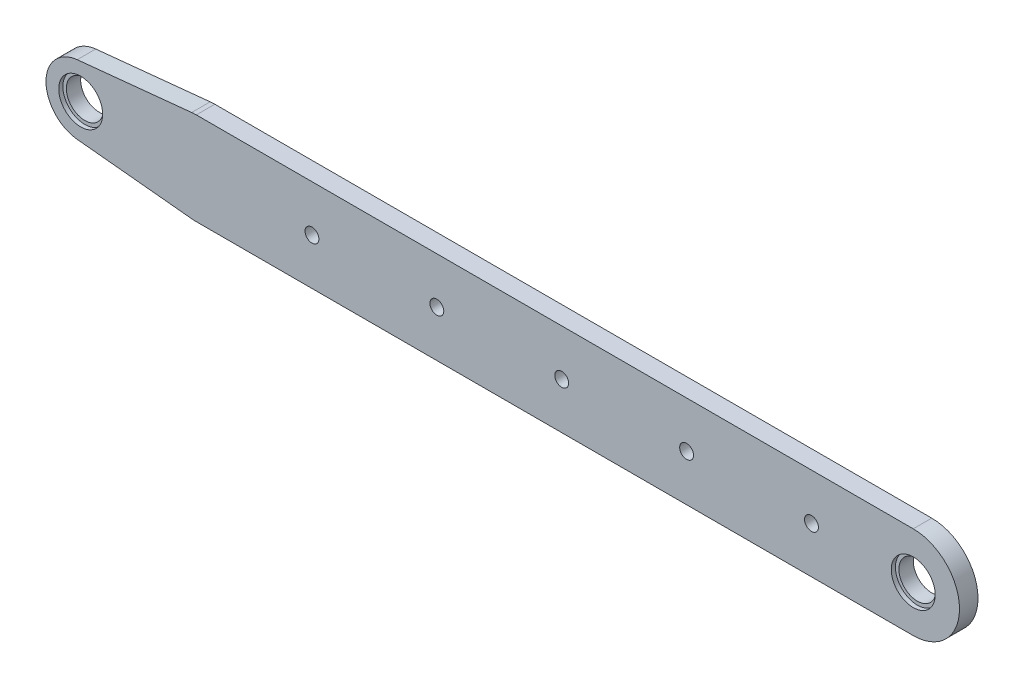
ISO-10303-21;
HEADER;
FILE_DESCRIPTION(('STEP AP214'),'2;1');
FILE_NAME('part.step','',(''),(''),'','','');
FILE_SCHEMA(('AUTOMOTIVE_DESIGN { 1 0 10303 214 1 1 1 1 }'));
ENDSEC;
DATA;
#1=APPLICATION_CONTEXT('core data for automotive mechanical design processes');
#2=APPLICATION_PROTOCOL_DEFINITION('international standard','automotive_design',2000,#1);
#3=PRODUCT_CONTEXT('',#1,'mechanical');
#4=PRODUCT('Part','Part','',(#3));
#5=PRODUCT_RELATED_PRODUCT_CATEGORY('part','',(#4));
#6=PRODUCT_DEFINITION_FORMATION('','',#4);
#7=PRODUCT_DEFINITION_CONTEXT('part definition',#1,'design');
#8=PRODUCT_DEFINITION('design','',#6,#7);
#9=PRODUCT_DEFINITION_SHAPE('','',#8);
#10=(LENGTH_UNIT() NAMED_UNIT(*) SI_UNIT(.MILLI.,.METRE.));
#11=(NAMED_UNIT(*) PLANE_ANGLE_UNIT() SI_UNIT($,.RADIAN.));
#12=(NAMED_UNIT(*) SI_UNIT($,.STERADIAN.) SOLID_ANGLE_UNIT());
#13=UNCERTAINTY_MEASURE_WITH_UNIT(LENGTH_MEASURE(1.E-05),#10,'distance_accuracy_value','');
#14=(GEOMETRIC_REPRESENTATION_CONTEXT(3) GLOBAL_UNCERTAINTY_ASSIGNED_CONTEXT((#13)) GLOBAL_UNIT_ASSIGNED_CONTEXT((#10,
#11,#12)) REPRESENTATION_CONTEXT('',''));
#15=CARTESIAN_POINT('',(0.,0.,0.));
#16=DIRECTION('',(0.,0.,1.));
#17=DIRECTION('',(1.,0.,0.));
#18=AXIS2_PLACEMENT_3D('',#15,#16,#17);
#19=CARTESIAN_POINT('',(0.,10.,4.));
#20=DIRECTION('',(0.,1.,0.));
#21=DIRECTION('',(0.,0.,1.));
#22=AXIS2_PLACEMENT_3D('',#19,#20,#21);
#23=PLANE('',#22);
#24=DIRECTION('',(1.,0.,0.));
#25=VECTOR('',#24,1.);
#26=CARTESIAN_POINT('',(0.,10.,0.));
#27=LINE('',#26,#25);
#28=CARTESIAN_POINT('',(-77.5,10.,0.));
#29=VERTEX_POINT('',#28);
#30=CARTESIAN_POINT('',(77.5,10.,0.));
#31=VERTEX_POINT('',#30);
#32=EDGE_CURVE('E138',#29,#31,#27,.T.);
#33=ORIENTED_EDGE('',*,*,#32,.F.);
#34=DIRECTION('',(0.,0.,-1.));
#35=VECTOR('',#34,1.);
#36=CARTESIAN_POINT('',(-77.5,10.,4.));
#37=LINE('',#36,#35);
#38=CARTESIAN_POINT('',(-77.5,10.,4.));
#39=VERTEX_POINT('',#38);
#40=EDGE_CURVE('E11',#39,#29,#37,.T.);
#41=ORIENTED_EDGE('',*,*,#40,.F.);
#42=DIRECTION('',(1.,0.,0.));
#43=VECTOR('',#42,1.);
#44=CARTESIAN_POINT('',(0.,10.,4.));
#45=LINE('',#44,#43);
#46=CARTESIAN_POINT('',(77.5,10.,4.));
#47=VERTEX_POINT('',#46);
#48=EDGE_CURVE('E155',#39,#47,#45,.T.);
#49=ORIENTED_EDGE('',*,*,#48,.T.);
#50=DIRECTION('',(0.,0.,-1.));
#51=VECTOR('',#50,1.);
#52=CARTESIAN_POINT('',(77.5,10.,4.));
#53=LINE('',#52,#51);
#54=EDGE_CURVE('E94',#47,#31,#53,.T.);
#55=ORIENTED_EDGE('',*,*,#54,.T.);
#56=EDGE_LOOP('',(#33,#41,#49,#55));
#57=FACE_BOUND('',#56,.T.);
#58=ADVANCED_FACE('F43',(#57),#23,.T.);
#59=CARTESIAN_POINT('',(-77.5,0.,4.));
#60=DIRECTION('',(0.,0.,-1.));
#61=DIRECTION('',(-1.,0.,0.));
#62=AXIS2_PLACEMENT_3D('',#59,#60,#61);
#63=CYLINDRICAL_SURFACE('',#62,10.);
#64=CARTESIAN_POINT('',(-77.5,0.,0.));
#65=DIRECTION('',(0.,0.,1.));
#66=DIRECTION('',(1.,0.,0.));
#67=AXIS2_PLACEMENT_3D('',#64,#65,#66);
#68=CIRCLE('',#67,10.);
#69=CARTESIAN_POINT('',(-78.5,9.94987437106622,0.));
#70=VERTEX_POINT('',#69);
#71=EDGE_CURVE('E141',#29,#70,#68,.T.);
#72=ORIENTED_EDGE('',*,*,#71,.T.);
#73=DIRECTION('',(0.,0.,-1.));
#74=VECTOR('',#73,1.);
#75=CARTESIAN_POINT('',(-78.5,9.94987437106622,4.));
#76=LINE('',#75,#74);
#77=CARTESIAN_POINT('',(-78.5,9.94987437106622,4.));
#78=VERTEX_POINT('',#77);
#79=EDGE_CURVE('E51',#78,#70,#76,.T.);
#80=ORIENTED_EDGE('',*,*,#79,.F.);
#81=CARTESIAN_POINT('',(-77.5,0.,4.));
#82=DIRECTION('',(0.,0.,1.));
#83=DIRECTION('',(1.,0.,0.));
#84=AXIS2_PLACEMENT_3D('',#81,#82,#83);
#85=CIRCLE('',#84,10.);
#86=EDGE_CURVE('E124',#39,#78,#85,.T.);
#87=ORIENTED_EDGE('',*,*,#86,.F.);
#88=ORIENTED_EDGE('',*,*,#40,.T.);
#89=EDGE_LOOP('',(#72,#80,#87,#88));
#90=FACE_BOUND('',#89,.T.);
#91=ADVANCED_FACE('F172',(#90),#63,.T.);
#92=CARTESIAN_POINT('',(-1.77499999999999,17.6610270086425,4.));
#93=DIRECTION('',(-0.0999999999999995,0.99498743710662,0.));
#94=DIRECTION('',(-0.99498743710662,-0.0999999999999995,0.));
#95=AXIS2_PLACEMENT_3D('',#92,#93,#94);
#96=PLANE('',#95);
#97=DIRECTION('',(0.99498743710662,0.0999999999999995,0.));
#98=VECTOR('',#97,1.);
#99=CARTESIAN_POINT('',(-1.77499999999999,17.6610270086425,0.));
#100=LINE('',#99,#98);
#101=CARTESIAN_POINT('',(-103.25,7.46240577829968,0.));
#102=VERTEX_POINT('',#101);
#103=EDGE_CURVE('E145',#102,#70,#100,.T.);
#104=ORIENTED_EDGE('',*,*,#103,.F.);
#105=DIRECTION('',(0.,0.,-1.));
#106=VECTOR('',#105,1.);
#107=CARTESIAN_POINT('',(-103.25,7.46240577829968,4.));
#108=LINE('',#107,#106);
#109=CARTESIAN_POINT('',(-103.25,7.46240577829968,4.));
#110=VERTEX_POINT('',#109);
#111=EDGE_CURVE('E162',#110,#102,#108,.T.);
#112=ORIENTED_EDGE('',*,*,#111,.F.);
#113=DIRECTION('',(0.99498743710662,0.0999999999999995,0.));
#114=VECTOR('',#113,1.);
#115=CARTESIAN_POINT('',(-1.77499999999999,17.6610270086425,4.));
#116=LINE('',#115,#114);
#117=EDGE_CURVE('E169',#110,#78,#116,.T.);
#118=ORIENTED_EDGE('',*,*,#117,.T.);
#119=ORIENTED_EDGE('',*,*,#79,.T.);
#120=EDGE_LOOP('',(#104,#112,#118,#119));
#121=FACE_BOUND('',#120,.T.);
#122=ADVANCED_FACE('F167',(#121),#96,.T.);
#123=CARTESIAN_POINT('',(-102.5,0.,4.));
#124=DIRECTION('',(0.,0.,-1.));
#125=DIRECTION('',(-1.,0.,0.));
#126=AXIS2_PLACEMENT_3D('',#123,#124,#125);
#127=CYLINDRICAL_SURFACE('',#126,7.50000000000003);
#128=CARTESIAN_POINT('',(-102.5,0.,0.));
#129=DIRECTION('',(0.,0.,1.));
#130=DIRECTION('',(1.,0.,0.));
#131=AXIS2_PLACEMENT_3D('',#128,#129,#130);
#132=CIRCLE('',#131,7.50000000000003);
#133=CARTESIAN_POINT('',(-103.25,-7.46240577829969,0.));
#134=VERTEX_POINT('',#133);
#135=EDGE_CURVE('E148',#102,#134,#132,.T.);
#136=ORIENTED_EDGE('',*,*,#135,.T.);
#137=DIRECTION('',(0.,0.,-1.));
#138=VECTOR('',#137,1.);
#139=CARTESIAN_POINT('',(-103.25,-7.46240577829969,4.));
#140=LINE('',#139,#138);
#141=CARTESIAN_POINT('',(-103.25,-7.46240577829969,4.));
#142=VERTEX_POINT('',#141);
#143=EDGE_CURVE('E159',#142,#134,#140,.T.);
#144=ORIENTED_EDGE('',*,*,#143,.F.);
#145=CARTESIAN_POINT('',(-102.5,0.,4.));
#146=DIRECTION('',(0.,0.,1.));
#147=DIRECTION('',(1.,0.,0.));
#148=AXIS2_PLACEMENT_3D('',#145,#146,#147);
#149=CIRCLE('',#148,7.50000000000003);
#150=EDGE_CURVE('E183',#110,#142,#149,.T.);
#151=ORIENTED_EDGE('',*,*,#150,.F.);
#152=ORIENTED_EDGE('',*,*,#111,.T.);
#153=EDGE_LOOP('',(#136,#144,#151,#152));
#154=FACE_BOUND('',#153,.T.);
#155=ADVANCED_FACE('F179',(#154),#127,.T.);
#156=CARTESIAN_POINT('',(-1.77499999999998,-17.6610270086425,4.));
#157=DIRECTION('',(0.0999999999999992,0.99498743710662,0.));
#158=DIRECTION('',(-0.99498743710662,0.0999999999999992,0.));
#159=AXIS2_PLACEMENT_3D('',#156,#157,#158);
#160=PLANE('',#159);
#161=DIRECTION('',(0.99498743710662,-0.0999999999999992,0.));
#162=VECTOR('',#161,1.);
#163=CARTESIAN_POINT('',(-1.77499999999998,-17.6610270086425,0.));
#164=LINE('',#163,#162);
#165=CARTESIAN_POINT('',(-78.5,-9.94987437106621,0.));
#166=VERTEX_POINT('',#165);
#167=EDGE_CURVE('E150',#134,#166,#164,.T.);
#168=ORIENTED_EDGE('',*,*,#167,.T.);
#169=DIRECTION('',(0.,0.,-1.));
#170=VECTOR('',#169,1.);
#171=CARTESIAN_POINT('',(-78.5,-9.94987437106621,4.));
#172=LINE('',#171,#170);
#173=CARTESIAN_POINT('',(-78.5,-9.94987437106621,4.));
#174=VERTEX_POINT('',#173);
#175=EDGE_CURVE('E129',#174,#166,#172,.T.);
#176=ORIENTED_EDGE('',*,*,#175,.F.);
#177=DIRECTION('',(0.99498743710662,-0.0999999999999992,0.));
#178=VECTOR('',#177,1.);
#179=CARTESIAN_POINT('',(-1.77499999999998,-17.6610270086425,4.));
#180=LINE('',#179,#178);
#181=EDGE_CURVE('E119',#142,#174,#180,.T.);
#182=ORIENTED_EDGE('',*,*,#181,.F.);
#183=ORIENTED_EDGE('',*,*,#143,.T.);
#184=EDGE_LOOP('',(#168,#176,#182,#183));
#185=FACE_BOUND('',#184,.T.);
#186=ADVANCED_FACE('F182',(#185),#160,.F.);
#187=CARTESIAN_POINT('',(-77.5,-10.,0.));
#188=VERTEX_POINT('',#187);
#189=EDGE_CURVE('E128',#166,#188,#68,.T.);
#190=ORIENTED_EDGE('',*,*,#189,.T.);
#191=DIRECTION('',(0.,0.,-1.));
#192=VECTOR('',#191,1.);
#193=CARTESIAN_POINT('',(-77.5,-10.,4.));
#194=LINE('',#193,#192);
#195=CARTESIAN_POINT('',(-77.5,-10.,4.));
#196=VERTEX_POINT('',#195);
#197=EDGE_CURVE('E125',#196,#188,#194,.T.);
#198=ORIENTED_EDGE('',*,*,#197,.F.);
#199=EDGE_CURVE('E113',#174,#196,#85,.T.);
#200=ORIENTED_EDGE('',*,*,#199,.F.);
#201=ORIENTED_EDGE('',*,*,#175,.T.);
#202=EDGE_LOOP('',(#190,#198,#200,#201));
#203=FACE_BOUND('',#202,.T.);
#204=ADVANCED_FACE('F126',(#203),#63,.T.);
#205=CARTESIAN_POINT('',(0.,-10.,4.));
#206=DIRECTION('',(0.,1.,0.));
#207=DIRECTION('',(0.,0.,1.));
#208=AXIS2_PLACEMENT_3D('',#205,#206,#207);
#209=PLANE('',#208);
#210=DIRECTION('',(1.,0.,0.));
#211=VECTOR('',#210,1.);
#212=CARTESIAN_POINT('',(0.,-10.,0.));
#213=LINE('',#212,#211);
#214=CARTESIAN_POINT('',(77.5,-10.,0.));
#215=VERTEX_POINT('',#214);
#216=EDGE_CURVE('E87',#188,#215,#213,.T.);
#217=ORIENTED_EDGE('',*,*,#216,.T.);
#218=DIRECTION('',(0.,0.,-1.));
#219=VECTOR('',#218,1.);
#220=CARTESIAN_POINT('',(77.5,-10.,4.));
#221=LINE('',#220,#219);
#222=CARTESIAN_POINT('',(77.5,-10.,4.));
#223=VERTEX_POINT('',#222);
#224=EDGE_CURVE('E130',#223,#215,#221,.T.);
#225=ORIENTED_EDGE('',*,*,#224,.F.);
#226=DIRECTION('',(1.,0.,0.));
#227=VECTOR('',#226,1.);
#228=CARTESIAN_POINT('',(0.,-10.,4.));
#229=LINE('',#228,#227);
#230=EDGE_CURVE('E117',#196,#223,#229,.T.);
#231=ORIENTED_EDGE('',*,*,#230,.F.);
#232=ORIENTED_EDGE('',*,*,#197,.T.);
#233=EDGE_LOOP('',(#217,#225,#231,#232));
#234=FACE_BOUND('',#233,.T.);
#235=ADVANCED_FACE('F132',(#234),#209,.F.);
#236=CARTESIAN_POINT('',(77.5,0.,4.));
#237=DIRECTION('',(0.,0.,-1.));
#238=DIRECTION('',(-1.,0.,0.));
#239=AXIS2_PLACEMENT_3D('',#236,#237,#238);
#240=CYLINDRICAL_SURFACE('',#239,10.);
#241=CARTESIAN_POINT('',(77.5,0.,0.));
#242=DIRECTION('',(0.,0.,1.));
#243=DIRECTION('',(1.,0.,0.));
#244=AXIS2_PLACEMENT_3D('',#241,#242,#243);
#245=CIRCLE('',#244,10.);
#246=EDGE_CURVE('E153',#215,#31,#245,.T.);
#247=ORIENTED_EDGE('',*,*,#246,.T.);
#248=ORIENTED_EDGE('',*,*,#54,.F.);
#249=CARTESIAN_POINT('',(77.5,0.,4.));
#250=DIRECTION('',(0.,0.,1.));
#251=DIRECTION('',(1.,0.,0.));
#252=AXIS2_PLACEMENT_3D('',#249,#250,#251);
#253=CIRCLE('',#252,10.);
#254=EDGE_CURVE('E59',#223,#47,#253,.T.);
#255=ORIENTED_EDGE('',*,*,#254,.F.);
#256=ORIENTED_EDGE('',*,*,#224,.T.);
#257=EDGE_LOOP('',(#247,#248,#255,#256));
#258=FACE_BOUND('',#257,.T.);
#259=ADVANCED_FACE('F261',(#258),#240,.T.);
#260=CARTESIAN_POINT('',(0.,0.,4.));
#261=DIRECTION('',(0.,0.,1.));
#262=DIRECTION('',(1.,0.,0.));
#263=AXIS2_PLACEMENT_3D('',#260,#261,#262);
#264=PLANE('',#263);
#265=CARTESIAN_POINT('',(-52.5,0.,4.));
#266=DIRECTION('',(0.,0.,1.));
#267=DIRECTION('',(1.,0.,0.));
#268=AXIS2_PLACEMENT_3D('',#265,#266,#267);
#269=CIRCLE('',#268,1.5);
#270=CARTESIAN_POINT('',(-51.,0.,4.));
#271=VERTEX_POINT('',#270);
#272=EDGE_CURVE('E210',#271,#271,#269,.T.);
#273=ORIENTED_EDGE('',*,*,#272,.F.);
#274=EDGE_LOOP('',(#273));
#275=FACE_BOUND('',#274,.T.);
#276=CARTESIAN_POINT('',(-25.5,0.,4.));
#277=DIRECTION('',(0.,0.,1.));
#278=DIRECTION('',(1.,0.,0.));
#279=AXIS2_PLACEMENT_3D('',#276,#277,#278);
#280=CIRCLE('',#279,1.5);
#281=CARTESIAN_POINT('',(-24.,0.,4.));
#282=VERTEX_POINT('',#281);
#283=EDGE_CURVE('E213',#282,#282,#280,.T.);
#284=ORIENTED_EDGE('',*,*,#283,.F.);
#285=EDGE_LOOP('',(#284));
#286=FACE_BOUND('',#285,.T.);
#287=CARTESIAN_POINT('',(1.50000000000001,0.,4.));
#288=DIRECTION('',(0.,0.,1.));
#289=DIRECTION('',(1.,0.,0.));
#290=AXIS2_PLACEMENT_3D('',#287,#288,#289);
#291=CIRCLE('',#290,1.5);
#292=CARTESIAN_POINT('',(3.00000000000001,0.,4.));
#293=VERTEX_POINT('',#292);
#294=EDGE_CURVE('E216',#293,#293,#291,.T.);
#295=ORIENTED_EDGE('',*,*,#294,.F.);
#296=EDGE_LOOP('',(#295));
#297=FACE_BOUND('',#296,.T.);
#298=CARTESIAN_POINT('',(28.5,0.,4.));
#299=DIRECTION('',(0.,0.,1.));
#300=DIRECTION('',(1.,0.,0.));
#301=AXIS2_PLACEMENT_3D('',#298,#299,#300);
#302=CIRCLE('',#301,1.5);
#303=CARTESIAN_POINT('',(30.,0.,4.));
#304=VERTEX_POINT('',#303);
#305=EDGE_CURVE('E219',#304,#304,#302,.T.);
#306=ORIENTED_EDGE('',*,*,#305,.F.);
#307=EDGE_LOOP('',(#306));
#308=FACE_BOUND('',#307,.T.);
#309=CARTESIAN_POINT('',(55.5,0.,4.));
#310=DIRECTION('',(0.,0.,1.));
#311=DIRECTION('',(1.,0.,0.));
#312=AXIS2_PLACEMENT_3D('',#309,#310,#311);
#313=CIRCLE('',#312,1.5);
#314=CARTESIAN_POINT('',(57.,0.,4.));
#315=VERTEX_POINT('',#314);
#316=EDGE_CURVE('E222',#315,#315,#313,.T.);
#317=ORIENTED_EDGE('',*,*,#316,.F.);
#318=EDGE_LOOP('',(#317));
#319=FACE_BOUND('',#318,.T.);
#320=CARTESIAN_POINT('',(-102.5,0.,4.));
#321=DIRECTION('',(0.,0.,1.));
#322=DIRECTION('',(1.,0.,0.));
#323=AXIS2_PLACEMENT_3D('',#320,#321,#322);
#324=CIRCLE('',#323,4.75);
#325=CARTESIAN_POINT('',(-97.75,0.,4.));
#326=VERTEX_POINT('',#325);
#327=EDGE_CURVE('E207',#326,#326,#324,.T.);
#328=ORIENTED_EDGE('',*,*,#327,.F.);
#329=EDGE_LOOP('',(#328));
#330=FACE_BOUND('',#329,.T.);
#331=CARTESIAN_POINT('',(77.5,0.,4.));
#332=DIRECTION('',(0.,0.,1.));
#333=DIRECTION('',(1.,0.,0.));
#334=AXIS2_PLACEMENT_3D('',#331,#332,#333);
#335=CIRCLE('',#334,4.75);
#336=CARTESIAN_POINT('',(82.25,0.,4.));
#337=VERTEX_POINT('',#336);
#338=EDGE_CURVE('E195',#337,#337,#335,.T.);
#339=ORIENTED_EDGE('',*,*,#338,.F.);
#340=EDGE_LOOP('',(#339));
#341=FACE_BOUND('',#340,.T.);
#342=ORIENTED_EDGE('',*,*,#48,.F.);
#343=ORIENTED_EDGE('',*,*,#86,.T.);
#344=ORIENTED_EDGE('',*,*,#117,.F.);
#345=ORIENTED_EDGE('',*,*,#150,.T.);
#346=ORIENTED_EDGE('',*,*,#181,.T.);
#347=ORIENTED_EDGE('',*,*,#199,.T.);
#348=ORIENTED_EDGE('',*,*,#230,.T.);
#349=ORIENTED_EDGE('',*,*,#254,.T.);
#350=EDGE_LOOP('',(#342,#343,#344,#345,#346,#347,#348,#349));
#351=FACE_BOUND('',#350,.T.);
#352=ADVANCED_FACE('F115',(#275,#286,#297,#308,#319,#330,#341,#351),#264,.T.);
#353=CARTESIAN_POINT('',(0.,0.,0.));
#354=DIRECTION('',(0.,0.,1.));
#355=DIRECTION('',(1.,0.,0.));
#356=AXIS2_PLACEMENT_3D('',#353,#354,#355);
#357=PLANE('',#356);
#358=CARTESIAN_POINT('',(-52.5,0.,0.));
#359=DIRECTION('',(0.,0.,1.));
#360=DIRECTION('',(1.,0.,0.));
#361=AXIS2_PLACEMENT_3D('',#358,#359,#360);
#362=CIRCLE('',#361,1.5);
#363=CARTESIAN_POINT('',(-51.,0.,0.));
#364=VERTEX_POINT('',#363);
#365=EDGE_CURVE('E225',#364,#364,#362,.T.);
#366=ORIENTED_EDGE('',*,*,#365,.T.);
#367=EDGE_LOOP('',(#366));
#368=FACE_BOUND('',#367,.T.);
#369=CARTESIAN_POINT('',(-25.5,0.,0.));
#370=DIRECTION('',(0.,0.,1.));
#371=DIRECTION('',(1.,0.,0.));
#372=AXIS2_PLACEMENT_3D('',#369,#370,#371);
#373=CIRCLE('',#372,1.5);
#374=CARTESIAN_POINT('',(-24.,0.,0.));
#375=VERTEX_POINT('',#374);
#376=EDGE_CURVE('E235',#375,#375,#373,.T.);
#377=ORIENTED_EDGE('',*,*,#376,.T.);
#378=EDGE_LOOP('',(#377));
#379=FACE_BOUND('',#378,.T.);
#380=CARTESIAN_POINT('',(1.50000000000001,0.,0.));
#381=DIRECTION('',(0.,0.,1.));
#382=DIRECTION('',(1.,0.,0.));
#383=AXIS2_PLACEMENT_3D('',#380,#381,#382);
#384=CIRCLE('',#383,1.5);
#385=CARTESIAN_POINT('',(3.00000000000001,0.,0.));
#386=VERTEX_POINT('',#385);
#387=EDGE_CURVE('E232',#386,#386,#384,.T.);
#388=ORIENTED_EDGE('',*,*,#387,.T.);
#389=EDGE_LOOP('',(#388));
#390=FACE_BOUND('',#389,.T.);
#391=CARTESIAN_POINT('',(28.5,0.,0.));
#392=DIRECTION('',(0.,0.,1.));
#393=DIRECTION('',(1.,0.,0.));
#394=AXIS2_PLACEMENT_3D('',#391,#392,#393);
#395=CIRCLE('',#394,1.5);
#396=CARTESIAN_POINT('',(30.,0.,0.));
#397=VERTEX_POINT('',#396);
#398=EDGE_CURVE('E229',#397,#397,#395,.T.);
#399=ORIENTED_EDGE('',*,*,#398,.T.);
#400=EDGE_LOOP('',(#399));
#401=FACE_BOUND('',#400,.T.);
#402=CARTESIAN_POINT('',(55.5,0.,0.));
#403=DIRECTION('',(0.,0.,1.));
#404=DIRECTION('',(1.,0.,0.));
#405=AXIS2_PLACEMENT_3D('',#402,#403,#404);
#406=CIRCLE('',#405,1.5);
#407=CARTESIAN_POINT('',(57.,0.,0.));
#408=VERTEX_POINT('',#407);
#409=EDGE_CURVE('E226',#408,#408,#406,.T.);
#410=ORIENTED_EDGE('',*,*,#409,.T.);
#411=EDGE_LOOP('',(#410));
#412=FACE_BOUND('',#411,.T.);
#413=CARTESIAN_POINT('',(-102.5,0.,0.));
#414=DIRECTION('',(0.,0.,1.));
#415=DIRECTION('',(1.,0.,0.));
#416=AXIS2_PLACEMENT_3D('',#413,#414,#415);
#417=CIRCLE('',#416,4.);
#418=CARTESIAN_POINT('',(-98.5,0.,0.));
#419=VERTEX_POINT('',#418);
#420=EDGE_CURVE('E198',#419,#419,#417,.T.);
#421=ORIENTED_EDGE('',*,*,#420,.T.);
#422=EDGE_LOOP('',(#421));
#423=FACE_BOUND('',#422,.T.);
#424=CARTESIAN_POINT('',(77.5,0.,0.));
#425=DIRECTION('',(0.,0.,1.));
#426=DIRECTION('',(1.,0.,0.));
#427=AXIS2_PLACEMENT_3D('',#424,#425,#426);
#428=CIRCLE('',#427,4.);
#429=CARTESIAN_POINT('',(81.5,0.,0.));
#430=VERTEX_POINT('',#429);
#431=EDGE_CURVE('E142',#430,#430,#428,.T.);
#432=ORIENTED_EDGE('',*,*,#431,.T.);
#433=EDGE_LOOP('',(#432));
#434=FACE_BOUND('',#433,.T.);
#435=ORIENTED_EDGE('',*,*,#32,.T.);
#436=ORIENTED_EDGE('',*,*,#246,.F.);
#437=ORIENTED_EDGE('',*,*,#216,.F.);
#438=ORIENTED_EDGE('',*,*,#189,.F.);
#439=ORIENTED_EDGE('',*,*,#167,.F.);
#440=ORIENTED_EDGE('',*,*,#135,.F.);
#441=ORIENTED_EDGE('',*,*,#103,.T.);
#442=ORIENTED_EDGE('',*,*,#71,.F.);
#443=EDGE_LOOP('',(#435,#436,#437,#438,#439,#440,#441,#442));
#444=FACE_BOUND('',#443,.T.);
#445=ADVANCED_FACE('F175',(#368,#379,#390,#401,#412,#423,#434,#444),#357,.F.);
#446=CARTESIAN_POINT('',(77.5,0.,4.));
#447=DIRECTION('',(0.,0.,1.));
#448=DIRECTION('',(1.,0.,0.));
#449=AXIS2_PLACEMENT_3D('',#446,#447,#448);
#450=CYLINDRICAL_SURFACE('',#449,4.);
#451=ORIENTED_EDGE('',*,*,#431,.F.);
#452=EDGE_LOOP('',(#451));
#453=FACE_BOUND('',#452,.T.);
#454=CARTESIAN_POINT('',(77.5,0.,3.1));
#455=DIRECTION('',(0.,0.,1.));
#456=DIRECTION('',(1.,0.,0.));
#457=AXIS2_PLACEMENT_3D('',#454,#455,#456);
#458=CIRCLE('',#457,4.);
#459=CARTESIAN_POINT('',(81.5,0.,3.1));
#460=VERTEX_POINT('',#459);
#461=EDGE_CURVE('E189',#460,#460,#458,.T.);
#462=ORIENTED_EDGE('',*,*,#461,.T.);
#463=EDGE_LOOP('',(#462));
#464=FACE_BOUND('',#463,.T.);
#465=ADVANCED_FACE('F319',(#453,#464),#450,.F.);
#466=CARTESIAN_POINT('',(81.5,0.,3.1));
#467=DIRECTION('',(0.,0.,-1.));
#468=DIRECTION('',(-1.,0.,0.));
#469=AXIS2_PLACEMENT_3D('',#466,#467,#468);
#470=PLANE('',#469);
#471=ORIENTED_EDGE('',*,*,#461,.F.);
#472=EDGE_LOOP('',(#471));
#473=FACE_BOUND('',#472,.T.);
#474=CARTESIAN_POINT('',(77.5,0.,3.1));
#475=DIRECTION('',(0.,0.,1.));
#476=DIRECTION('',(1.,0.,0.));
#477=AXIS2_PLACEMENT_3D('',#474,#475,#476);
#478=CIRCLE('',#477,4.75);
#479=CARTESIAN_POINT('',(82.25,0.,3.1));
#480=VERTEX_POINT('',#479);
#481=EDGE_CURVE('E192',#480,#480,#478,.T.);
#482=ORIENTED_EDGE('',*,*,#481,.T.);
#483=EDGE_LOOP('',(#482));
#484=FACE_BOUND('',#483,.T.);
#485=ADVANCED_FACE('F327',(#473,#484),#470,.F.);
#486=CARTESIAN_POINT('',(77.5,0.,4.));
#487=DIRECTION('',(0.,0.,1.));
#488=DIRECTION('',(1.,0.,0.));
#489=AXIS2_PLACEMENT_3D('',#486,#487,#488);
#490=CYLINDRICAL_SURFACE('',#489,4.75);
#491=ORIENTED_EDGE('',*,*,#481,.F.);
#492=EDGE_LOOP('',(#491));
#493=FACE_BOUND('',#492,.T.);
#494=ORIENTED_EDGE('',*,*,#338,.T.);
#495=EDGE_LOOP('',(#494));
#496=FACE_BOUND('',#495,.T.);
#497=ADVANCED_FACE('F337',(#493,#496),#490,.F.);
#498=CARTESIAN_POINT('',(-102.5,0.,4.));
#499=DIRECTION('',(0.,0.,1.));
#500=DIRECTION('',(1.,0.,0.));
#501=AXIS2_PLACEMENT_3D('',#498,#499,#500);
#502=CYLINDRICAL_SURFACE('',#501,4.);
#503=ORIENTED_EDGE('',*,*,#420,.F.);
#504=EDGE_LOOP('',(#503));
#505=FACE_BOUND('',#504,.T.);
#506=CARTESIAN_POINT('',(-102.5,0.,3.1));
#507=DIRECTION('',(0.,0.,1.));
#508=DIRECTION('',(1.,0.,0.));
#509=AXIS2_PLACEMENT_3D('',#506,#507,#508);
#510=CIRCLE('',#509,4.);
#511=CARTESIAN_POINT('',(-98.5,0.,3.1));
#512=VERTEX_POINT('',#511);
#513=EDGE_CURVE('E201',#512,#512,#510,.T.);
#514=ORIENTED_EDGE('',*,*,#513,.T.);
#515=EDGE_LOOP('',(#514));
#516=FACE_BOUND('',#515,.T.);
#517=ADVANCED_FACE('F347',(#505,#516),#502,.F.);
#518=CARTESIAN_POINT('',(-98.5,0.,3.1));
#519=DIRECTION('',(0.,0.,-1.));
#520=DIRECTION('',(-1.,0.,0.));
#521=AXIS2_PLACEMENT_3D('',#518,#519,#520);
#522=PLANE('',#521);
#523=ORIENTED_EDGE('',*,*,#513,.F.);
#524=EDGE_LOOP('',(#523));
#525=FACE_BOUND('',#524,.T.);
#526=CARTESIAN_POINT('',(-102.5,0.,3.1));
#527=DIRECTION('',(0.,0.,1.));
#528=DIRECTION('',(1.,0.,0.));
#529=AXIS2_PLACEMENT_3D('',#526,#527,#528);
#530=CIRCLE('',#529,4.75);
#531=CARTESIAN_POINT('',(-97.75,0.,3.1));
#532=VERTEX_POINT('',#531);
#533=EDGE_CURVE('E204',#532,#532,#530,.T.);
#534=ORIENTED_EDGE('',*,*,#533,.T.);
#535=EDGE_LOOP('',(#534));
#536=FACE_BOUND('',#535,.T.);
#537=ADVANCED_FACE('F357',(#525,#536),#522,.F.);
#538=CARTESIAN_POINT('',(-102.5,0.,4.));
#539=DIRECTION('',(0.,0.,1.));
#540=DIRECTION('',(1.,0.,0.));
#541=AXIS2_PLACEMENT_3D('',#538,#539,#540);
#542=CYLINDRICAL_SURFACE('',#541,4.75);
#543=ORIENTED_EDGE('',*,*,#533,.F.);
#544=EDGE_LOOP('',(#543));
#545=FACE_BOUND('',#544,.T.);
#546=ORIENTED_EDGE('',*,*,#327,.T.);
#547=EDGE_LOOP('',(#546));
#548=FACE_BOUND('',#547,.T.);
#549=ADVANCED_FACE('F367',(#545,#548),#542,.F.);
#550=CARTESIAN_POINT('',(55.5,0.,0.));
#551=DIRECTION('',(0.,0.,1.));
#552=DIRECTION('',(1.,0.,0.));
#553=AXIS2_PLACEMENT_3D('',#550,#551,#552);
#554=CYLINDRICAL_SURFACE('',#553,1.5);
#555=ORIENTED_EDGE('',*,*,#316,.T.);
#556=EDGE_LOOP('',(#555));
#557=FACE_BOUND('',#556,.T.);
#558=ORIENTED_EDGE('',*,*,#409,.F.);
#559=EDGE_LOOP('',(#558));
#560=FACE_BOUND('',#559,.T.);
#561=ADVANCED_FACE('F376',(#557,#560),#554,.F.);
#562=CARTESIAN_POINT('',(28.5,0.,0.));
#563=DIRECTION('',(0.,0.,1.));
#564=DIRECTION('',(1.,0.,0.));
#565=AXIS2_PLACEMENT_3D('',#562,#563,#564);
#566=CYLINDRICAL_SURFACE('',#565,1.5);
#567=ORIENTED_EDGE('',*,*,#305,.T.);
#568=EDGE_LOOP('',(#567));
#569=FACE_BOUND('',#568,.T.);
#570=ORIENTED_EDGE('',*,*,#398,.F.);
#571=EDGE_LOOP('',(#570));
#572=FACE_BOUND('',#571,.T.);
#573=ADVANCED_FACE('F385',(#569,#572),#566,.F.);
#574=CARTESIAN_POINT('',(1.50000000000001,0.,0.));
#575=DIRECTION('',(0.,0.,1.));
#576=DIRECTION('',(1.,0.,0.));
#577=AXIS2_PLACEMENT_3D('',#574,#575,#576);
#578=CYLINDRICAL_SURFACE('',#577,1.5);
#579=ORIENTED_EDGE('',*,*,#294,.T.);
#580=EDGE_LOOP('',(#579));
#581=FACE_BOUND('',#580,.T.);
#582=ORIENTED_EDGE('',*,*,#387,.F.);
#583=EDGE_LOOP('',(#582));
#584=FACE_BOUND('',#583,.T.);
#585=ADVANCED_FACE('F251',(#581,#584),#578,.F.);
#586=CARTESIAN_POINT('',(-25.5,0.,0.));
#587=DIRECTION('',(0.,0.,1.));
#588=DIRECTION('',(1.,0.,0.));
#589=AXIS2_PLACEMENT_3D('',#586,#587,#588);
#590=CYLINDRICAL_SURFACE('',#589,1.5);
#591=ORIENTED_EDGE('',*,*,#283,.T.);
#592=EDGE_LOOP('',(#591));
#593=FACE_BOUND('',#592,.T.);
#594=ORIENTED_EDGE('',*,*,#376,.F.);
#595=EDGE_LOOP('',(#594));
#596=FACE_BOUND('',#595,.T.);
#597=ADVANCED_FACE('F245',(#593,#596),#590,.F.);
#598=CARTESIAN_POINT('',(-52.5,0.,0.));
#599=DIRECTION('',(0.,0.,1.));
#600=DIRECTION('',(1.,0.,0.));
#601=AXIS2_PLACEMENT_3D('',#598,#599,#600);
#602=CYLINDRICAL_SURFACE('',#601,1.5);
#603=ORIENTED_EDGE('',*,*,#272,.T.);
#604=EDGE_LOOP('',(#603));
#605=FACE_BOUND('',#604,.T.);
#606=ORIENTED_EDGE('',*,*,#365,.F.);
#607=EDGE_LOOP('',(#606));
#608=FACE_BOUND('',#607,.T.);
#609=ADVANCED_FACE('F243',(#605,#608),#602,.F.);
#610=CLOSED_SHELL('',(#58,#91,#122,#155,#186,#204,#235,#259,#352,#445,#465,#485,#497,#517,#537,
#549,#561,#573,#585,#597,#609));
#611=MANIFOLD_SOLID_BREP('B2',#610);
#612=ADVANCED_BREP_SHAPE_REPRESENTATION('',(#18,#611),#14);
#613=SHAPE_DEFINITION_REPRESENTATION(#9,#612);
ENDSEC;
END-ISO-10303-21;
